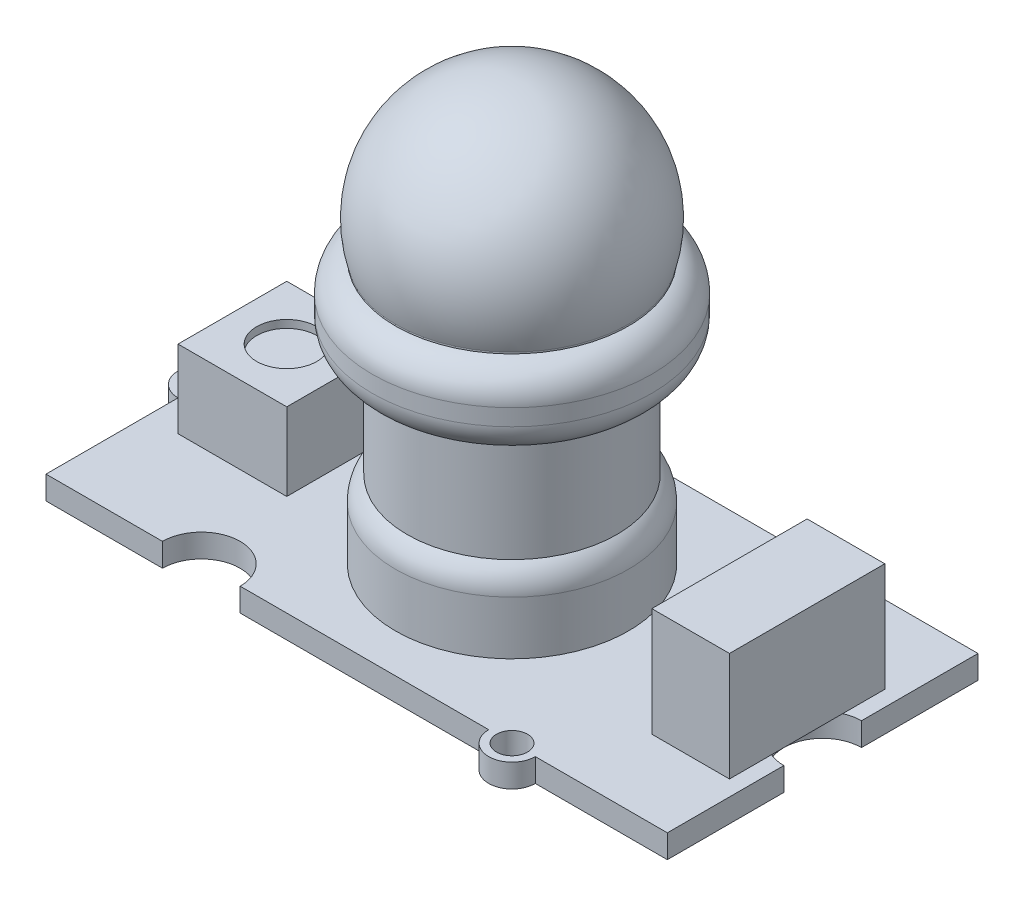
ISO-10303-21;
HEADER;
FILE_DESCRIPTION(('STEP AP214'),'2;1');
FILE_NAME('part.step','',(''),(''),'','','');
FILE_SCHEMA(('AUTOMOTIVE_DESIGN { 1 0 10303 214 1 1 1 1 }'));
ENDSEC;
DATA;
#1=APPLICATION_CONTEXT('core data for automotive mechanical design processes');
#2=APPLICATION_PROTOCOL_DEFINITION('international standard','automotive_design',2000,#1);
#3=PRODUCT_CONTEXT('',#1,'mechanical');
#4=PRODUCT('Part','Part','',(#3));
#5=PRODUCT_RELATED_PRODUCT_CATEGORY('part','',(#4));
#6=PRODUCT_DEFINITION_FORMATION('','',#4);
#7=PRODUCT_DEFINITION_CONTEXT('part definition',#1,'design');
#8=PRODUCT_DEFINITION('design','',#6,#7);
#9=PRODUCT_DEFINITION_SHAPE('','',#8);
#10=(LENGTH_UNIT() NAMED_UNIT(*) SI_UNIT(.MILLI.,.METRE.));
#11=(NAMED_UNIT(*) PLANE_ANGLE_UNIT() SI_UNIT($,.RADIAN.));
#12=(NAMED_UNIT(*) SI_UNIT($,.STERADIAN.) SOLID_ANGLE_UNIT());
#13=UNCERTAINTY_MEASURE_WITH_UNIT(LENGTH_MEASURE(1.E-05),#10,'distance_accuracy_value','');
#14=(GEOMETRIC_REPRESENTATION_CONTEXT(3) GLOBAL_UNCERTAINTY_ASSIGNED_CONTEXT((#13)) GLOBAL_UNIT_ASSIGNED_CONTEXT((#10,
#11,#12)) REPRESENTATION_CONTEXT('',''));
#15=CARTESIAN_POINT('',(0.,0.,0.));
#16=DIRECTION('',(0.,0.,1.));
#17=DIRECTION('',(1.,0.,0.));
#18=AXIS2_PLACEMENT_3D('',#15,#16,#17);
#19=CARTESIAN_POINT('',(0.,1.5,0.));
#20=DIRECTION('',(0.,1.,0.));
#21=DIRECTION('',(0.,0.,1.));
#22=AXIS2_PLACEMENT_3D('',#19,#20,#21);
#23=PLANE('',#22);
#24=CARTESIAN_POINT('',(0.,1.5,0.));
#25=DIRECTION('',(0.,1.,0.));
#26=DIRECTION('',(0.,0.,1.));
#27=AXIS2_PLACEMENT_3D('',#24,#25,#26);
#28=CIRCLE('',#27,7.5);
#29=CARTESIAN_POINT('',(0.,1.5,7.5));
#30=VERTEX_POINT('',#29);
#31=EDGE_CURVE('E436',#30,#30,#28,.T.);
#32=ORIENTED_EDGE('',*,*,#31,.F.);
#33=EDGE_LOOP('',(#32));
#34=FACE_BOUND('',#33,.T.);
#35=CARTESIAN_POINT('',(10.,1.5,-10.));
#36=DIRECTION('',(0.,1.,0.));
#37=DIRECTION('',(0.,0.,1.));
#38=AXIS2_PLACEMENT_3D('',#35,#36,#37);
#39=CIRCLE('',#38,0.999999999999999);
#40=CARTESIAN_POINT('',(10.,1.5,-9.));
#41=VERTEX_POINT('',#40);
#42=EDGE_CURVE('E293',#41,#41,#39,.T.);
#43=ORIENTED_EDGE('',*,*,#42,.F.);
#44=EDGE_LOOP('',(#43));
#45=FACE_BOUND('',#44,.T.);
#46=CARTESIAN_POINT('',(9.99999999999999,1.5,10.));
#47=DIRECTION('',(0.,1.,0.));
#48=DIRECTION('',(0.,0.,1.));
#49=AXIS2_PLACEMENT_3D('',#46,#47,#48);
#50=CIRCLE('',#49,1.);
#51=CARTESIAN_POINT('',(9.99999999999999,1.5,11.));
#52=VERTEX_POINT('',#51);
#53=EDGE_CURVE('E297',#52,#52,#50,.T.);
#54=ORIENTED_EDGE('',*,*,#53,.F.);
#55=EDGE_LOOP('',(#54));
#56=FACE_BOUND('',#55,.T.);
#57=CARTESIAN_POINT('',(-20.,1.5,0.));
#58=DIRECTION('',(0.,1.,0.));
#59=DIRECTION('',(0.,0.,1.));
#60=AXIS2_PLACEMENT_3D('',#57,#58,#59);
#61=CIRCLE('',#60,1.);
#62=CARTESIAN_POINT('',(-20.,1.5,1.));
#63=VERTEX_POINT('',#62);
#64=EDGE_CURVE('E303',#63,#63,#61,.T.);
#65=ORIENTED_EDGE('',*,*,#64,.F.);
#66=EDGE_LOOP('',(#65));
#67=FACE_BOUND('',#66,.T.);
#68=DIRECTION('',(-1.,0.,0.));
#69=VECTOR('',#68,1.);
#70=CARTESIAN_POINT('',(-18.,1.5,-3.5));
#71=LINE('',#70,#69);
#72=CARTESIAN_POINT('',(-11.,1.5,-3.5));
#73=VERTEX_POINT('',#72);
#74=CARTESIAN_POINT('',(-18.,1.5,-3.5));
#75=VERTEX_POINT('',#74);
#76=EDGE_CURVE('E250',#73,#75,#71,.T.);
#77=ORIENTED_EDGE('',*,*,#76,.F.);
#78=DIRECTION('',(0.,0.,-1.));
#79=VECTOR('',#78,1.);
#80=CARTESIAN_POINT('',(-11.,1.5,-3.5));
#81=LINE('',#80,#79);
#82=CARTESIAN_POINT('',(-11.,1.5,3.5));
#83=VERTEX_POINT('',#82);
#84=EDGE_CURVE('E235',#83,#73,#81,.T.);
#85=ORIENTED_EDGE('',*,*,#84,.F.);
#86=DIRECTION('',(1.,0.,0.));
#87=VECTOR('',#86,1.);
#88=CARTESIAN_POINT('',(-18.,1.5,3.5));
#89=LINE('',#88,#87);
#90=CARTESIAN_POINT('',(-18.,1.5,3.5));
#91=VERTEX_POINT('',#90);
#92=EDGE_CURVE('E241',#91,#83,#89,.T.);
#93=ORIENTED_EDGE('',*,*,#92,.F.);
#94=DIRECTION('',(0.,0.,1.));
#95=VECTOR('',#94,1.);
#96=CARTESIAN_POINT('',(-18.,1.5,-3.5));
#97=LINE('',#96,#95);
#98=EDGE_CURVE('E252',#75,#91,#97,.T.);
#99=ORIENTED_EDGE('',*,*,#98,.F.);
#100=EDGE_LOOP('',(#77,#85,#93,#99));
#101=FACE_BOUND('',#100,.T.);
#102=DIRECTION('',(-1.,0.,0.));
#103=VECTOR('',#102,1.);
#104=CARTESIAN_POINT('',(14.,1.5,-5.));
#105=LINE('',#104,#103);
#106=CARTESIAN_POINT('',(19.,1.5,-5.));
#107=VERTEX_POINT('',#106);
#108=CARTESIAN_POINT('',(14.,1.5,-5.));
#109=VERTEX_POINT('',#108);
#110=EDGE_CURVE('E445',#107,#109,#105,.T.);
#111=ORIENTED_EDGE('',*,*,#110,.F.);
#112=DIRECTION('',(0.,0.,-1.));
#113=VECTOR('',#112,1.);
#114=CARTESIAN_POINT('',(19.,1.5,-5.));
#115=LINE('',#114,#113);
#116=CARTESIAN_POINT('',(19.,1.5,-2.29128784747792));
#117=VERTEX_POINT('',#116);
#118=EDGE_CURVE('E224',#117,#107,#115,.T.);
#119=ORIENTED_EDGE('',*,*,#118,.F.);
#120=CARTESIAN_POINT('',(20.,1.5,0.));
#121=DIRECTION('',(0.,1.,0.));
#122=DIRECTION('',(0.,0.,1.));
#123=AXIS2_PLACEMENT_3D('',#120,#121,#122);
#124=CIRCLE('',#123,2.5);
#125=CARTESIAN_POINT('',(20.,1.5,-2.5));
#126=VERTEX_POINT('',#125);
#127=EDGE_CURVE('E264',#126,#117,#124,.T.);
#128=ORIENTED_EDGE('',*,*,#127,.F.);
#129=DIRECTION('',(0.,0.,-1.));
#130=VECTOR('',#129,1.);
#131=CARTESIAN_POINT('',(20.,1.5,-10.));
#132=LINE('',#131,#130);
#133=CARTESIAN_POINT('',(20.,1.5,-10.));
#134=VERTEX_POINT('',#133);
#135=EDGE_CURVE('E346',#126,#134,#132,.T.);
#136=ORIENTED_EDGE('',*,*,#135,.T.);
#137=DIRECTION('',(-1.,0.,0.));
#138=VECTOR('',#137,1.);
#139=CARTESIAN_POINT('',(-20.,1.5,-10.));
#140=LINE('',#139,#138);
#141=CARTESIAN_POINT('',(11.5,1.5,-10.));
#142=VERTEX_POINT('',#141);
#143=EDGE_CURVE('E347',#134,#142,#140,.T.);
#144=ORIENTED_EDGE('',*,*,#143,.T.);
#145=CARTESIAN_POINT('',(10.,1.5,-10.));
#146=DIRECTION('',(0.,1.,0.));
#147=DIRECTION('',(0.,0.,1.));
#148=AXIS2_PLACEMENT_3D('',#145,#146,#147);
#149=CIRCLE('',#148,1.5);
#150=CARTESIAN_POINT('',(8.5,1.5,-10.));
#151=VERTEX_POINT('',#150);
#152=EDGE_CURVE('E321',#142,#151,#149,.T.);
#153=ORIENTED_EDGE('',*,*,#152,.T.);
#154=CARTESIAN_POINT('',(-7.50000000000001,1.5,-10.));
#155=VERTEX_POINT('',#154);
#156=EDGE_CURVE('E351',#151,#155,#140,.T.);
#157=ORIENTED_EDGE('',*,*,#156,.T.);
#158=CARTESIAN_POINT('',(-10.,1.5,-10.));
#159=DIRECTION('',(0.,1.,0.));
#160=DIRECTION('',(0.,0.,1.));
#161=AXIS2_PLACEMENT_3D('',#158,#159,#160);
#162=CIRCLE('',#161,2.5);
#163=CARTESIAN_POINT('',(-12.5,1.5,-10.));
#164=VERTEX_POINT('',#163);
#165=EDGE_CURVE('E274',#164,#155,#162,.T.);
#166=ORIENTED_EDGE('',*,*,#165,.F.);
#167=CARTESIAN_POINT('',(-20.,1.5,-10.));
#168=VERTEX_POINT('',#167);
#169=EDGE_CURVE('E345',#164,#168,#140,.T.);
#170=ORIENTED_EDGE('',*,*,#169,.T.);
#171=DIRECTION('',(0.,0.,1.));
#172=VECTOR('',#171,1.);
#173=CARTESIAN_POINT('',(-20.,1.5,-10.));
#174=LINE('',#173,#172);
#175=CARTESIAN_POINT('',(-20.,1.5,-1.5));
#176=VERTEX_POINT('',#175);
#177=EDGE_CURVE('E352',#168,#176,#174,.T.);
#178=ORIENTED_EDGE('',*,*,#177,.T.);
#179=CARTESIAN_POINT('',(-20.,1.5,0.));
#180=DIRECTION('',(0.,1.,0.));
#181=DIRECTION('',(0.,0.,1.));
#182=AXIS2_PLACEMENT_3D('',#179,#180,#181);
#183=CIRCLE('',#182,1.5);
#184=CARTESIAN_POINT('',(-20.,1.5,1.5));
#185=VERTEX_POINT('',#184);
#186=EDGE_CURVE('E331',#176,#185,#183,.T.);
#187=ORIENTED_EDGE('',*,*,#186,.T.);
#188=CARTESIAN_POINT('',(-20.,1.5,10.));
#189=VERTEX_POINT('',#188);
#190=EDGE_CURVE('E350',#185,#189,#174,.T.);
#191=ORIENTED_EDGE('',*,*,#190,.T.);
#192=DIRECTION('',(1.,0.,0.));
#193=VECTOR('',#192,1.);
#194=CARTESIAN_POINT('',(-20.,1.5,10.));
#195=LINE('',#194,#193);
#196=CARTESIAN_POINT('',(-12.5,1.5,10.));
#197=VERTEX_POINT('',#196);
#198=EDGE_CURVE('E356',#189,#197,#195,.T.);
#199=ORIENTED_EDGE('',*,*,#198,.T.);
#200=CARTESIAN_POINT('',(-10.,1.5,10.));
#201=DIRECTION('',(0.,1.,0.));
#202=DIRECTION('',(0.,0.,1.));
#203=AXIS2_PLACEMENT_3D('',#200,#201,#202);
#204=CIRCLE('',#203,2.5);
#205=CARTESIAN_POINT('',(-7.5,1.5,10.));
#206=VERTEX_POINT('',#205);
#207=EDGE_CURVE('E282',#206,#197,#204,.T.);
#208=ORIENTED_EDGE('',*,*,#207,.F.);
#209=CARTESIAN_POINT('',(8.49999999999999,1.5,10.));
#210=VERTEX_POINT('',#209);
#211=EDGE_CURVE('E360',#206,#210,#195,.T.);
#212=ORIENTED_EDGE('',*,*,#211,.T.);
#213=CARTESIAN_POINT('',(9.99999999999999,1.5,10.));
#214=DIRECTION('',(0.,1.,0.));
#215=DIRECTION('',(0.,0.,1.));
#216=AXIS2_PLACEMENT_3D('',#213,#214,#215);
#217=CIRCLE('',#216,1.5);
#218=CARTESIAN_POINT('',(11.5,1.5,10.));
#219=VERTEX_POINT('',#218);
#220=EDGE_CURVE('E309',#210,#219,#217,.T.);
#221=ORIENTED_EDGE('',*,*,#220,.T.);
#222=CARTESIAN_POINT('',(20.,1.5,10.));
#223=VERTEX_POINT('',#222);
#224=EDGE_CURVE('E355',#219,#223,#195,.T.);
#225=ORIENTED_EDGE('',*,*,#224,.T.);
#226=CARTESIAN_POINT('',(20.,1.5,2.5));
#227=VERTEX_POINT('',#226);
#228=EDGE_CURVE('E342',#223,#227,#132,.T.);
#229=ORIENTED_EDGE('',*,*,#228,.T.);
#230=CARTESIAN_POINT('',(19.,1.5,2.29128784747792));
#231=VERTEX_POINT('',#230);
#232=EDGE_CURVE('E263',#231,#227,#124,.T.);
#233=ORIENTED_EDGE('',*,*,#232,.F.);
#234=CARTESIAN_POINT('',(19.,1.5,5.));
#235=VERTEX_POINT('',#234);
#236=EDGE_CURVE('E47',#235,#231,#115,.T.);
#237=ORIENTED_EDGE('',*,*,#236,.F.);
#238=DIRECTION('',(1.,0.,0.));
#239=VECTOR('',#238,1.);
#240=CARTESIAN_POINT('',(14.,1.5,5.));
#241=LINE('',#240,#239);
#242=CARTESIAN_POINT('',(14.,1.5,5.));
#243=VERTEX_POINT('',#242);
#244=EDGE_CURVE('E220',#243,#235,#241,.T.);
#245=ORIENTED_EDGE('',*,*,#244,.F.);
#246=DIRECTION('',(0.,0.,1.));
#247=VECTOR('',#246,1.);
#248=CARTESIAN_POINT('',(14.,1.5,-5.));
#249=LINE('',#248,#247);
#250=EDGE_CURVE('E448',#109,#243,#249,.T.);
#251=ORIENTED_EDGE('',*,*,#250,.F.);
#252=EDGE_LOOP('',(#111,#119,#128,#136,#144,#153,#157,#166,#170,#178,#187,#191,#199,#208,#212,
#221,#225,#229,#233,#237,#245,#251));
#253=FACE_BOUND('',#252,.T.);
#254=ADVANCED_FACE('F32',(#34,#45,#56,#67,#101,#253),#23,.T.);
#255=CARTESIAN_POINT('',(20.,1.5,-10.));
#256=DIRECTION('',(-1.,0.,0.));
#257=DIRECTION('',(0.,0.,1.));
#258=AXIS2_PLACEMENT_3D('',#255,#256,#257);
#259=PLANE('',#258);
#260=DIRECTION('',(0.,0.,-1.));
#261=VECTOR('',#260,1.);
#262=CARTESIAN_POINT('',(20.,0.,-10.));
#263=LINE('',#262,#261);
#264=CARTESIAN_POINT('',(20.,0.,10.));
#265=VERTEX_POINT('',#264);
#266=CARTESIAN_POINT('',(20.,0.,2.5));
#267=VERTEX_POINT('',#266);
#268=EDGE_CURVE('E361',#265,#267,#263,.T.);
#269=ORIENTED_EDGE('',*,*,#268,.T.);
#270=DIRECTION('',(0.,1.,0.));
#271=VECTOR('',#270,1.);
#272=CARTESIAN_POINT('',(20.,0.,2.5));
#273=LINE('',#272,#271);
#274=EDGE_CURVE('E271',#267,#227,#273,.T.);
#275=ORIENTED_EDGE('',*,*,#274,.T.);
#276=ORIENTED_EDGE('',*,*,#228,.F.);
#277=DIRECTION('',(0.,-1.,0.));
#278=VECTOR('',#277,1.);
#279=CARTESIAN_POINT('',(20.,1.5,10.));
#280=LINE('',#279,#278);
#281=EDGE_CURVE('E359',#223,#265,#280,.T.);
#282=ORIENTED_EDGE('',*,*,#281,.T.);
#283=EDGE_LOOP('',(#269,#275,#276,#282));
#284=FACE_BOUND('',#283,.T.);
#285=ADVANCED_FACE('F478',(#284),#259,.F.);
#286=CARTESIAN_POINT('',(-20.,1.5,-10.));
#287=DIRECTION('',(0.,0.,1.));
#288=DIRECTION('',(1.,0.,0.));
#289=AXIS2_PLACEMENT_3D('',#286,#287,#288);
#290=PLANE('',#289);
#291=DIRECTION('',(-1.,0.,0.));
#292=VECTOR('',#291,1.);
#293=CARTESIAN_POINT('',(-20.,0.,-10.));
#294=LINE('',#293,#292);
#295=CARTESIAN_POINT('',(8.5,0.,-10.));
#296=VERTEX_POINT('',#295);
#297=CARTESIAN_POINT('',(-7.50000000000001,0.,-10.));
#298=VERTEX_POINT('',#297);
#299=EDGE_CURVE('E369',#296,#298,#294,.T.);
#300=ORIENTED_EDGE('',*,*,#299,.T.);
#301=DIRECTION('',(0.,1.,0.));
#302=VECTOR('',#301,1.);
#303=CARTESIAN_POINT('',(-7.50000000000001,0.,-10.));
#304=LINE('',#303,#302);
#305=EDGE_CURVE('E279',#298,#155,#304,.T.);
#306=ORIENTED_EDGE('',*,*,#305,.T.);
#307=ORIENTED_EDGE('',*,*,#156,.F.);
#308=DIRECTION('',(0.,1.,0.));
#309=VECTOR('',#308,1.);
#310=CARTESIAN_POINT('',(8.5,0.,-10.));
#311=LINE('',#310,#309);
#312=EDGE_CURVE('E324',#151,#296,#311,.F.);
#313=ORIENTED_EDGE('',*,*,#312,.T.);
#314=EDGE_LOOP('',(#300,#306,#307,#313));
#315=FACE_BOUND('',#314,.T.);
#316=ADVANCED_FACE('F484',(#315),#290,.F.);
#317=CARTESIAN_POINT('',(-20.,1.5,10.));
#318=DIRECTION('',(0.,0.,-1.));
#319=DIRECTION('',(-1.,0.,0.));
#320=AXIS2_PLACEMENT_3D('',#317,#318,#319);
#321=PLANE('',#320);
#322=DIRECTION('',(1.,0.,0.));
#323=VECTOR('',#322,1.);
#324=CARTESIAN_POINT('',(-20.,0.,10.));
#325=LINE('',#324,#323);
#326=CARTESIAN_POINT('',(-20.,0.,10.));
#327=VERTEX_POINT('',#326);
#328=CARTESIAN_POINT('',(-12.5,0.,10.));
#329=VERTEX_POINT('',#328);
#330=EDGE_CURVE('E374',#327,#329,#325,.T.);
#331=ORIENTED_EDGE('',*,*,#330,.T.);
#332=DIRECTION('',(0.,1.,0.));
#333=VECTOR('',#332,1.);
#334=CARTESIAN_POINT('',(-12.5,0.,10.));
#335=LINE('',#334,#333);
#336=EDGE_CURVE('E290',#329,#197,#335,.T.);
#337=ORIENTED_EDGE('',*,*,#336,.T.);
#338=ORIENTED_EDGE('',*,*,#198,.F.);
#339=DIRECTION('',(0.,-1.,0.));
#340=VECTOR('',#339,1.);
#341=CARTESIAN_POINT('',(-20.,1.5,10.));
#342=LINE('',#341,#340);
#343=EDGE_CURVE('E380',#189,#327,#342,.T.);
#344=ORIENTED_EDGE('',*,*,#343,.T.);
#345=EDGE_LOOP('',(#331,#337,#338,#344));
#346=FACE_BOUND('',#345,.T.);
#347=ADVANCED_FACE('F503',(#346),#321,.F.);
#348=ORIENTED_EDGE('',*,*,#211,.F.);
#349=DIRECTION('',(0.,1.,0.));
#350=VECTOR('',#349,1.);
#351=CARTESIAN_POINT('',(-7.5,0.,10.));
#352=LINE('',#351,#350);
#353=CARTESIAN_POINT('',(-7.5,0.,10.));
#354=VERTEX_POINT('',#353);
#355=EDGE_CURVE('E286',#206,#354,#352,.F.);
#356=ORIENTED_EDGE('',*,*,#355,.T.);
#357=CARTESIAN_POINT('',(8.49999999999999,0.,10.));
#358=VERTEX_POINT('',#357);
#359=EDGE_CURVE('E377',#354,#358,#325,.T.);
#360=ORIENTED_EDGE('',*,*,#359,.T.);
#361=DIRECTION('',(0.,1.,0.));
#362=VECTOR('',#361,1.);
#363=CARTESIAN_POINT('',(8.49999999999999,0.,10.));
#364=LINE('',#363,#362);
#365=EDGE_CURVE('E318',#358,#210,#364,.T.);
#366=ORIENTED_EDGE('',*,*,#365,.T.);
#367=EDGE_LOOP('',(#348,#356,#360,#366));
#368=FACE_BOUND('',#367,.T.);
#369=ADVANCED_FACE('F504',(#368),#321,.F.);
#370=CARTESIAN_POINT('',(20.,0.,-10.));
#371=VERTEX_POINT('',#370);
#372=CARTESIAN_POINT('',(11.5,0.,-10.));
#373=VERTEX_POINT('',#372);
#374=EDGE_CURVE('E365',#371,#373,#294,.T.);
#375=ORIENTED_EDGE('',*,*,#374,.T.);
#376=DIRECTION('',(0.,1.,0.));
#377=VECTOR('',#376,1.);
#378=CARTESIAN_POINT('',(11.5,0.,-10.));
#379=LINE('',#378,#377);
#380=EDGE_CURVE('E328',#373,#142,#379,.T.);
#381=ORIENTED_EDGE('',*,*,#380,.T.);
#382=ORIENTED_EDGE('',*,*,#143,.F.);
#383=DIRECTION('',(0.,-1.,0.));
#384=VECTOR('',#383,1.);
#385=CARTESIAN_POINT('',(20.,1.5,-10.));
#386=LINE('',#385,#384);
#387=EDGE_CURVE('E386',#134,#371,#386,.T.);
#388=ORIENTED_EDGE('',*,*,#387,.T.);
#389=EDGE_LOOP('',(#375,#381,#382,#388));
#390=FACE_BOUND('',#389,.T.);
#391=ADVANCED_FACE('F512',(#390),#290,.F.);
#392=CARTESIAN_POINT('',(-20.,1.5,-10.));
#393=DIRECTION('',(1.,0.,0.));
#394=DIRECTION('',(0.,0.,-1.));
#395=AXIS2_PLACEMENT_3D('',#392,#393,#394);
#396=PLANE('',#395);
#397=DIRECTION('',(0.,0.,1.));
#398=VECTOR('',#397,1.);
#399=CARTESIAN_POINT('',(-20.,0.,-10.));
#400=LINE('',#399,#398);
#401=CARTESIAN_POINT('',(-20.,0.,-10.));
#402=VERTEX_POINT('',#401);
#403=CARTESIAN_POINT('',(-20.,0.,-1.5));
#404=VERTEX_POINT('',#403);
#405=EDGE_CURVE('E370',#402,#404,#400,.T.);
#406=ORIENTED_EDGE('',*,*,#405,.T.);
#407=DIRECTION('',(0.,1.,0.));
#408=VECTOR('',#407,1.);
#409=CARTESIAN_POINT('',(-20.,0.,-1.5));
#410=LINE('',#409,#408);
#411=EDGE_CURVE('E338',#404,#176,#410,.T.);
#412=ORIENTED_EDGE('',*,*,#411,.T.);
#413=ORIENTED_EDGE('',*,*,#177,.F.);
#414=DIRECTION('',(0.,-1.,0.));
#415=VECTOR('',#414,1.);
#416=CARTESIAN_POINT('',(-20.,1.5,-10.));
#417=LINE('',#416,#415);
#418=EDGE_CURVE('E383',#168,#402,#417,.T.);
#419=ORIENTED_EDGE('',*,*,#418,.T.);
#420=EDGE_LOOP('',(#406,#412,#413,#419));
#421=FACE_BOUND('',#420,.T.);
#422=ADVANCED_FACE('F509',(#421),#396,.F.);
#423=ORIENTED_EDGE('',*,*,#135,.F.);
#424=DIRECTION('',(0.,1.,0.));
#425=VECTOR('',#424,1.);
#426=CARTESIAN_POINT('',(20.,0.,-2.5));
#427=LINE('',#426,#425);
#428=CARTESIAN_POINT('',(20.,0.,-2.5));
#429=VERTEX_POINT('',#428);
#430=EDGE_CURVE('E267',#126,#429,#427,.F.);
#431=ORIENTED_EDGE('',*,*,#430,.T.);
#432=EDGE_CURVE('E341',#429,#371,#263,.T.);
#433=ORIENTED_EDGE('',*,*,#432,.T.);
#434=ORIENTED_EDGE('',*,*,#387,.F.);
#435=EDGE_LOOP('',(#423,#431,#433,#434));
#436=FACE_BOUND('',#435,.T.);
#437=ADVANCED_FACE('F487',(#436),#259,.F.);
#438=ORIENTED_EDGE('',*,*,#169,.F.);
#439=DIRECTION('',(0.,1.,0.));
#440=VECTOR('',#439,1.);
#441=CARTESIAN_POINT('',(-12.5,0.,-10.));
#442=LINE('',#441,#440);
#443=CARTESIAN_POINT('',(-12.5,0.,-10.));
#444=VERTEX_POINT('',#443);
#445=EDGE_CURVE('E276',#164,#444,#442,.F.);
#446=ORIENTED_EDGE('',*,*,#445,.T.);
#447=EDGE_CURVE('E364',#444,#402,#294,.T.);
#448=ORIENTED_EDGE('',*,*,#447,.T.);
#449=ORIENTED_EDGE('',*,*,#418,.F.);
#450=EDGE_LOOP('',(#438,#446,#448,#449));
#451=FACE_BOUND('',#450,.T.);
#452=ADVANCED_FACE('F507',(#451),#290,.F.);
#453=ORIENTED_EDGE('',*,*,#190,.F.);
#454=DIRECTION('',(0.,1.,0.));
#455=VECTOR('',#454,1.);
#456=CARTESIAN_POINT('',(-20.,0.,1.5));
#457=LINE('',#456,#455);
#458=CARTESIAN_POINT('',(-20.,0.,1.5));
#459=VERTEX_POINT('',#458);
#460=EDGE_CURVE('E334',#185,#459,#457,.F.);
#461=ORIENTED_EDGE('',*,*,#460,.T.);
#462=EDGE_CURVE('E368',#459,#327,#400,.T.);
#463=ORIENTED_EDGE('',*,*,#462,.T.);
#464=ORIENTED_EDGE('',*,*,#343,.F.);
#465=EDGE_LOOP('',(#453,#461,#463,#464));
#466=FACE_BOUND('',#465,.T.);
#467=ADVANCED_FACE('F501',(#466),#396,.F.);
#468=ORIENTED_EDGE('',*,*,#224,.F.);
#469=DIRECTION('',(0.,1.,0.));
#470=VECTOR('',#469,1.);
#471=CARTESIAN_POINT('',(11.5,0.,10.));
#472=LINE('',#471,#470);
#473=CARTESIAN_POINT('',(11.5,0.,10.));
#474=VERTEX_POINT('',#473);
#475=EDGE_CURVE('E314',#219,#474,#472,.F.);
#476=ORIENTED_EDGE('',*,*,#475,.T.);
#477=EDGE_CURVE('E373',#474,#265,#325,.T.);
#478=ORIENTED_EDGE('',*,*,#477,.T.);
#479=ORIENTED_EDGE('',*,*,#281,.F.);
#480=EDGE_LOOP('',(#468,#476,#478,#479));
#481=FACE_BOUND('',#480,.T.);
#482=ADVANCED_FACE('F497',(#481),#321,.F.);
#483=CARTESIAN_POINT('',(0.,0.,0.));
#484=DIRECTION('',(0.,1.,0.));
#485=DIRECTION('',(0.,0.,1.));
#486=AXIS2_PLACEMENT_3D('',#483,#484,#485);
#487=PLANE('',#486);
#488=CARTESIAN_POINT('',(10.,0.,-10.));
#489=DIRECTION('',(0.,1.,0.));
#490=DIRECTION('',(0.,0.,1.));
#491=AXIS2_PLACEMENT_3D('',#488,#489,#490);
#492=CIRCLE('',#491,0.999999999999999);
#493=CARTESIAN_POINT('',(10.,0.,-9.));
#494=VERTEX_POINT('',#493);
#495=EDGE_CURVE('E294',#494,#494,#492,.T.);
#496=ORIENTED_EDGE('',*,*,#495,.T.);
#497=EDGE_LOOP('',(#496));
#498=FACE_BOUND('',#497,.T.);
#499=CARTESIAN_POINT('',(9.99999999999999,0.,10.));
#500=DIRECTION('',(0.,1.,0.));
#501=DIRECTION('',(0.,0.,1.));
#502=AXIS2_PLACEMENT_3D('',#499,#500,#501);
#503=CIRCLE('',#502,1.);
#504=CARTESIAN_POINT('',(9.99999999999999,0.,11.));
#505=VERTEX_POINT('',#504);
#506=EDGE_CURVE('E300',#505,#505,#503,.T.);
#507=ORIENTED_EDGE('',*,*,#506,.T.);
#508=EDGE_LOOP('',(#507));
#509=FACE_BOUND('',#508,.T.);
#510=CARTESIAN_POINT('',(-20.,0.,0.));
#511=DIRECTION('',(0.,1.,0.));
#512=DIRECTION('',(0.,0.,1.));
#513=AXIS2_PLACEMENT_3D('',#510,#511,#512);
#514=CIRCLE('',#513,1.);
#515=CARTESIAN_POINT('',(-20.,0.,1.));
#516=VERTEX_POINT('',#515);
#517=EDGE_CURVE('E306',#516,#516,#514,.T.);
#518=ORIENTED_EDGE('',*,*,#517,.T.);
#519=EDGE_LOOP('',(#518));
#520=FACE_BOUND('',#519,.T.);
#521=ORIENTED_EDGE('',*,*,#432,.F.);
#522=CARTESIAN_POINT('',(20.,0.,0.));
#523=DIRECTION('',(0.,1.,0.));
#524=DIRECTION('',(0.,0.,1.));
#525=AXIS2_PLACEMENT_3D('',#522,#523,#524);
#526=CIRCLE('',#525,2.5);
#527=EDGE_CURVE('E392',#429,#267,#526,.T.);
#528=ORIENTED_EDGE('',*,*,#527,.T.);
#529=ORIENTED_EDGE('',*,*,#268,.F.);
#530=ORIENTED_EDGE('',*,*,#477,.F.);
#531=CARTESIAN_POINT('',(9.99999999999999,0.,10.));
#532=DIRECTION('',(0.,1.,0.));
#533=DIRECTION('',(0.,0.,1.));
#534=AXIS2_PLACEMENT_3D('',#531,#532,#533);
#535=CIRCLE('',#534,1.5);
#536=EDGE_CURVE('E312',#358,#474,#535,.T.);
#537=ORIENTED_EDGE('',*,*,#536,.F.);
#538=ORIENTED_EDGE('',*,*,#359,.F.);
#539=CARTESIAN_POINT('',(-10.,0.,10.));
#540=DIRECTION('',(0.,1.,0.));
#541=DIRECTION('',(0.,0.,1.));
#542=AXIS2_PLACEMENT_3D('',#539,#540,#541);
#543=CIRCLE('',#542,2.5);
#544=EDGE_CURVE('E283',#354,#329,#543,.T.);
#545=ORIENTED_EDGE('',*,*,#544,.T.);
#546=ORIENTED_EDGE('',*,*,#330,.F.);
#547=ORIENTED_EDGE('',*,*,#462,.F.);
#548=CARTESIAN_POINT('',(-20.,0.,0.));
#549=DIRECTION('',(0.,1.,0.));
#550=DIRECTION('',(0.,0.,1.));
#551=AXIS2_PLACEMENT_3D('',#548,#549,#550);
#552=CIRCLE('',#551,1.5);
#553=EDGE_CURVE('E332',#404,#459,#552,.T.);
#554=ORIENTED_EDGE('',*,*,#553,.F.);
#555=ORIENTED_EDGE('',*,*,#405,.F.);
#556=ORIENTED_EDGE('',*,*,#447,.F.);
#557=CARTESIAN_POINT('',(-10.,0.,-10.));
#558=DIRECTION('',(0.,1.,0.));
#559=DIRECTION('',(0.,0.,1.));
#560=AXIS2_PLACEMENT_3D('',#557,#558,#559);
#561=CIRCLE('',#560,2.5);
#562=EDGE_CURVE('E389',#444,#298,#561,.T.);
#563=ORIENTED_EDGE('',*,*,#562,.T.);
#564=ORIENTED_EDGE('',*,*,#299,.F.);
#565=CARTESIAN_POINT('',(10.,0.,-10.));
#566=DIRECTION('',(0.,1.,0.));
#567=DIRECTION('',(0.,0.,1.));
#568=AXIS2_PLACEMENT_3D('',#565,#566,#567);
#569=CIRCLE('',#568,1.5);
#570=EDGE_CURVE('E322',#373,#296,#569,.T.);
#571=ORIENTED_EDGE('',*,*,#570,.F.);
#572=ORIENTED_EDGE('',*,*,#374,.F.);
#573=EDGE_LOOP('',(#521,#528,#529,#530,#537,#538,#545,#546,#547,#554,#555,#556,#563,#564,#571,#572));
#574=FACE_BOUND('',#573,.T.);
#575=ADVANCED_FACE('F494',(#498,#509,#520,#574),#487,.F.);
#576=CARTESIAN_POINT('',(-20.,0.,0.));
#577=DIRECTION('',(0.,1.,0.));
#578=DIRECTION('',(0.,0.,1.));
#579=AXIS2_PLACEMENT_3D('',#576,#577,#578);
#580=CYLINDRICAL_SURFACE('',#579,1.5);
#581=ORIENTED_EDGE('',*,*,#411,.F.);
#582=ORIENTED_EDGE('',*,*,#553,.T.);
#583=ORIENTED_EDGE('',*,*,#460,.F.);
#584=ORIENTED_EDGE('',*,*,#186,.F.);
#585=EDGE_LOOP('',(#581,#582,#583,#584));
#586=FACE_BOUND('',#585,.T.);
#587=ADVANCED_FACE('F492',(#586),#580,.T.);
#588=CARTESIAN_POINT('',(10.,0.,-10.));
#589=DIRECTION('',(0.,1.,0.));
#590=DIRECTION('',(0.,0.,1.));
#591=AXIS2_PLACEMENT_3D('',#588,#589,#590);
#592=CYLINDRICAL_SURFACE('',#591,1.5);
#593=ORIENTED_EDGE('',*,*,#380,.F.);
#594=ORIENTED_EDGE('',*,*,#570,.T.);
#595=ORIENTED_EDGE('',*,*,#312,.F.);
#596=ORIENTED_EDGE('',*,*,#152,.F.);
#597=EDGE_LOOP('',(#593,#594,#595,#596));
#598=FACE_BOUND('',#597,.T.);
#599=ADVANCED_FACE('F598',(#598),#592,.T.);
#600=CARTESIAN_POINT('',(9.99999999999999,0.,10.));
#601=DIRECTION('',(0.,1.,0.));
#602=DIRECTION('',(0.,0.,1.));
#603=AXIS2_PLACEMENT_3D('',#600,#601,#602);
#604=CYLINDRICAL_SURFACE('',#603,1.5);
#605=ORIENTED_EDGE('',*,*,#365,.F.);
#606=ORIENTED_EDGE('',*,*,#536,.T.);
#607=ORIENTED_EDGE('',*,*,#475,.F.);
#608=ORIENTED_EDGE('',*,*,#220,.F.);
#609=EDGE_LOOP('',(#605,#606,#607,#608));
#610=FACE_BOUND('',#609,.T.);
#611=ADVANCED_FACE('F595',(#610),#604,.T.);
#612=CARTESIAN_POINT('',(-20.,0.,0.));
#613=DIRECTION('',(0.,1.,0.));
#614=DIRECTION('',(0.,0.,1.));
#615=AXIS2_PLACEMENT_3D('',#612,#613,#614);
#616=CYLINDRICAL_SURFACE('',#615,1.);
#617=ORIENTED_EDGE('',*,*,#517,.F.);
#618=EDGE_LOOP('',(#617));
#619=FACE_BOUND('',#618,.T.);
#620=ORIENTED_EDGE('',*,*,#64,.T.);
#621=EDGE_LOOP('',(#620));
#622=FACE_BOUND('',#621,.T.);
#623=ADVANCED_FACE('F591',(#619,#622),#616,.F.);
#624=CARTESIAN_POINT('',(9.99999999999999,0.,10.));
#625=DIRECTION('',(0.,1.,0.));
#626=DIRECTION('',(0.,0.,1.));
#627=AXIS2_PLACEMENT_3D('',#624,#625,#626);
#628=CYLINDRICAL_SURFACE('',#627,1.);
#629=ORIENTED_EDGE('',*,*,#506,.F.);
#630=EDGE_LOOP('',(#629));
#631=FACE_BOUND('',#630,.T.);
#632=ORIENTED_EDGE('',*,*,#53,.T.);
#633=EDGE_LOOP('',(#632));
#634=FACE_BOUND('',#633,.T.);
#635=ADVANCED_FACE('F587',(#631,#634),#628,.F.);
#636=CARTESIAN_POINT('',(10.,0.,-10.));
#637=DIRECTION('',(0.,1.,0.));
#638=DIRECTION('',(0.,0.,1.));
#639=AXIS2_PLACEMENT_3D('',#636,#637,#638);
#640=CYLINDRICAL_SURFACE('',#639,0.999999999999999);
#641=ORIENTED_EDGE('',*,*,#495,.F.);
#642=EDGE_LOOP('',(#641));
#643=FACE_BOUND('',#642,.T.);
#644=ORIENTED_EDGE('',*,*,#42,.T.);
#645=EDGE_LOOP('',(#644));
#646=FACE_BOUND('',#645,.T.);
#647=ADVANCED_FACE('F583',(#643,#646),#640,.F.);
#648=CARTESIAN_POINT('',(-10.,0.,10.));
#649=DIRECTION('',(0.,1.,0.));
#650=DIRECTION('',(0.,0.,1.));
#651=AXIS2_PLACEMENT_3D('',#648,#649,#650);
#652=CYLINDRICAL_SURFACE('',#651,2.5);
#653=ORIENTED_EDGE('',*,*,#544,.F.);
#654=ORIENTED_EDGE('',*,*,#355,.F.);
#655=ORIENTED_EDGE('',*,*,#207,.T.);
#656=ORIENTED_EDGE('',*,*,#336,.F.);
#657=EDGE_LOOP('',(#653,#654,#655,#656));
#658=FACE_BOUND('',#657,.T.);
#659=ADVANCED_FACE('F579',(#658),#652,.F.);
#660=CARTESIAN_POINT('',(-10.,0.,-10.));
#661=DIRECTION('',(0.,1.,0.));
#662=DIRECTION('',(0.,0.,1.));
#663=AXIS2_PLACEMENT_3D('',#660,#661,#662);
#664=CYLINDRICAL_SURFACE('',#663,2.5);
#665=ORIENTED_EDGE('',*,*,#562,.F.);
#666=ORIENTED_EDGE('',*,*,#445,.F.);
#667=ORIENTED_EDGE('',*,*,#165,.T.);
#668=ORIENTED_EDGE('',*,*,#305,.F.);
#669=EDGE_LOOP('',(#665,#666,#667,#668));
#670=FACE_BOUND('',#669,.T.);
#671=ADVANCED_FACE('F576',(#670),#664,.F.);
#672=CARTESIAN_POINT('',(20.,0.,0.));
#673=DIRECTION('',(0.,1.,0.));
#674=DIRECTION('',(0.,0.,1.));
#675=AXIS2_PLACEMENT_3D('',#672,#673,#674);
#676=CYLINDRICAL_SURFACE('',#675,2.5);
#677=ORIENTED_EDGE('',*,*,#527,.F.);
#678=ORIENTED_EDGE('',*,*,#430,.F.);
#679=ORIENTED_EDGE('',*,*,#127,.T.);
#680=EDGE_CURVE('E268',#117,#231,#124,.T.);
#681=ORIENTED_EDGE('',*,*,#680,.T.);
#682=ORIENTED_EDGE('',*,*,#232,.T.);
#683=ORIENTED_EDGE('',*,*,#274,.F.);
#684=EDGE_LOOP('',(#677,#678,#679,#681,#682,#683));
#685=FACE_BOUND('',#684,.T.);
#686=ADVANCED_FACE('F463',(#685),#676,.F.);
#687=CARTESIAN_POINT('',(-11.,6.5,-3.5));
#688=DIRECTION('',(-1.,0.,0.));
#689=DIRECTION('',(0.,0.,1.));
#690=AXIS2_PLACEMENT_3D('',#687,#688,#689);
#691=PLANE('',#690);
#692=ORIENTED_EDGE('',*,*,#84,.T.);
#693=DIRECTION('',(0.,-1.,0.));
#694=VECTOR('',#693,1.);
#695=CARTESIAN_POINT('',(-11.,6.5,-3.5));
#696=LINE('',#695,#694);
#697=CARTESIAN_POINT('',(-11.,6.5,-3.5));
#698=VERTEX_POINT('',#697);
#699=EDGE_CURVE('E261',#698,#73,#696,.T.);
#700=ORIENTED_EDGE('',*,*,#699,.F.);
#701=DIRECTION('',(0.,0.,-1.));
#702=VECTOR('',#701,1.);
#703=CARTESIAN_POINT('',(-11.,6.5,-3.5));
#704=LINE('',#703,#702);
#705=CARTESIAN_POINT('',(-11.,6.5,3.5));
#706=VERTEX_POINT('',#705);
#707=EDGE_CURVE('E237',#706,#698,#704,.T.);
#708=ORIENTED_EDGE('',*,*,#707,.F.);
#709=DIRECTION('',(0.,-1.,0.));
#710=VECTOR('',#709,1.);
#711=CARTESIAN_POINT('',(-11.,6.5,3.5));
#712=LINE('',#711,#710);
#713=EDGE_CURVE('E247',#706,#83,#712,.T.);
#714=ORIENTED_EDGE('',*,*,#713,.T.);
#715=EDGE_LOOP('',(#692,#700,#708,#714));
#716=FACE_BOUND('',#715,.T.);
#717=ADVANCED_FACE('F569',(#716),#691,.F.);
#718=CARTESIAN_POINT('',(-18.,6.5,-3.5));
#719=DIRECTION('',(0.,0.,1.));
#720=DIRECTION('',(1.,0.,0.));
#721=AXIS2_PLACEMENT_3D('',#718,#719,#720);
#722=PLANE('',#721);
#723=ORIENTED_EDGE('',*,*,#76,.T.);
#724=DIRECTION('',(0.,-1.,0.));
#725=VECTOR('',#724,1.);
#726=CARTESIAN_POINT('',(-18.,6.5,-3.5));
#727=LINE('',#726,#725);
#728=CARTESIAN_POINT('',(-18.,6.5,-3.5));
#729=VERTEX_POINT('',#728);
#730=EDGE_CURVE('E258',#729,#75,#727,.T.);
#731=ORIENTED_EDGE('',*,*,#730,.F.);
#732=DIRECTION('',(-1.,0.,0.));
#733=VECTOR('',#732,1.);
#734=CARTESIAN_POINT('',(-18.,6.5,-3.5));
#735=LINE('',#734,#733);
#736=EDGE_CURVE('E240',#698,#729,#735,.T.);
#737=ORIENTED_EDGE('',*,*,#736,.F.);
#738=ORIENTED_EDGE('',*,*,#699,.T.);
#739=EDGE_LOOP('',(#723,#731,#737,#738));
#740=FACE_BOUND('',#739,.T.);
#741=ADVANCED_FACE('F565',(#740),#722,.F.);
#742=CARTESIAN_POINT('',(-18.,6.5,-3.5));
#743=DIRECTION('',(1.,0.,0.));
#744=DIRECTION('',(0.,0.,-1.));
#745=AXIS2_PLACEMENT_3D('',#742,#743,#744);
#746=PLANE('',#745);
#747=ORIENTED_EDGE('',*,*,#98,.T.);
#748=DIRECTION('',(0.,-1.,0.));
#749=VECTOR('',#748,1.);
#750=CARTESIAN_POINT('',(-18.,6.5,3.5));
#751=LINE('',#750,#749);
#752=CARTESIAN_POINT('',(-18.,6.5,3.5));
#753=VERTEX_POINT('',#752);
#754=EDGE_CURVE('E55',#753,#91,#751,.T.);
#755=ORIENTED_EDGE('',*,*,#754,.F.);
#756=DIRECTION('',(0.,0.,1.));
#757=VECTOR('',#756,1.);
#758=CARTESIAN_POINT('',(-18.,6.5,-3.5));
#759=LINE('',#758,#757);
#760=EDGE_CURVE('E243',#729,#753,#759,.T.);
#761=ORIENTED_EDGE('',*,*,#760,.F.);
#762=ORIENTED_EDGE('',*,*,#730,.T.);
#763=EDGE_LOOP('',(#747,#755,#761,#762));
#764=FACE_BOUND('',#763,.T.);
#765=ADVANCED_FACE('F562',(#764),#746,.F.);
#766=CARTESIAN_POINT('',(-18.,6.5,3.5));
#767=DIRECTION('',(0.,0.,-1.));
#768=DIRECTION('',(-1.,0.,0.));
#769=AXIS2_PLACEMENT_3D('',#766,#767,#768);
#770=PLANE('',#769);
#771=ORIENTED_EDGE('',*,*,#92,.T.);
#772=ORIENTED_EDGE('',*,*,#713,.F.);
#773=DIRECTION('',(1.,0.,0.));
#774=VECTOR('',#773,1.);
#775=CARTESIAN_POINT('',(-18.,6.5,3.5));
#776=LINE('',#775,#774);
#777=EDGE_CURVE('E245',#753,#706,#776,.T.);
#778=ORIENTED_EDGE('',*,*,#777,.F.);
#779=ORIENTED_EDGE('',*,*,#754,.T.);
#780=EDGE_LOOP('',(#771,#772,#778,#779));
#781=FACE_BOUND('',#780,.T.);
#782=ADVANCED_FACE('F558',(#781),#770,.F.);
#783=CARTESIAN_POINT('',(0.,6.5,0.));
#784=DIRECTION('',(0.,1.,0.));
#785=DIRECTION('',(0.,0.,1.));
#786=AXIS2_PLACEMENT_3D('',#783,#784,#785);
#787=PLANE('',#786);
#788=CARTESIAN_POINT('',(-14.5,6.5,0.));
#789=DIRECTION('',(0.,1.,0.));
#790=DIRECTION('',(0.,0.,1.));
#791=AXIS2_PLACEMENT_3D('',#788,#789,#790);
#792=CIRCLE('',#791,1.94075389858249);
#793=CARTESIAN_POINT('',(-14.5,6.5,1.94075389858249));
#794=VERTEX_POINT('',#793);
#795=EDGE_CURVE('E225',#794,#794,#792,.T.);
#796=ORIENTED_EDGE('',*,*,#795,.F.);
#797=EDGE_LOOP('',(#796));
#798=FACE_BOUND('',#797,.T.);
#799=ORIENTED_EDGE('',*,*,#707,.T.);
#800=ORIENTED_EDGE('',*,*,#736,.T.);
#801=ORIENTED_EDGE('',*,*,#760,.T.);
#802=ORIENTED_EDGE('',*,*,#777,.T.);
#803=EDGE_LOOP('',(#799,#800,#801,#802));
#804=FACE_BOUND('',#803,.T.);
#805=ADVANCED_FACE('F552',(#798,#804),#787,.T.);
#806=CARTESIAN_POINT('',(-14.5,6.,0.));
#807=DIRECTION('',(0.,1.,0.));
#808=DIRECTION('',(0.,0.,1.));
#809=AXIS2_PLACEMENT_3D('',#806,#807,#808);
#810=CYLINDRICAL_SURFACE('',#809,1.94075389858249);
#811=CARTESIAN_POINT('',(-14.5,6.,0.));
#812=DIRECTION('',(0.,1.,0.));
#813=DIRECTION('',(0.,0.,1.));
#814=AXIS2_PLACEMENT_3D('',#811,#812,#813);
#815=CIRCLE('',#814,1.94075389858249);
#816=CARTESIAN_POINT('',(-14.5,6.,1.94075389858249));
#817=VERTEX_POINT('',#816);
#818=EDGE_CURVE('E228',#817,#817,#815,.T.);
#819=ORIENTED_EDGE('',*,*,#818,.F.);
#820=EDGE_LOOP('',(#819));
#821=FACE_BOUND('',#820,.T.);
#822=ORIENTED_EDGE('',*,*,#795,.T.);
#823=EDGE_LOOP('',(#822));
#824=FACE_BOUND('',#823,.T.);
#825=ADVANCED_FACE('F546',(#821,#824),#810,.F.);
#826=CARTESIAN_POINT('',(-14.5,6.,0.));
#827=DIRECTION('',(0.,1.,0.));
#828=DIRECTION('',(0.,0.,1.));
#829=AXIS2_PLACEMENT_3D('',#826,#827,#828);
#830=PLANE('',#829);
#831=ORIENTED_EDGE('',*,*,#818,.T.);
#832=EDGE_LOOP('',(#831));
#833=FACE_BOUND('',#832,.T.);
#834=ADVANCED_FACE('F540',(#833),#830,.T.);
#835=CARTESIAN_POINT('',(0.,1.5,0.));
#836=DIRECTION('',(0.,1.,0.));
#837=DIRECTION('',(0.,0.,1.));
#838=AXIS2_PLACEMENT_3D('',#835,#836,#837);
#839=PLANE('',#838);
#840=EDGE_CURVE('E446',#231,#117,#115,.T.);
#841=ORIENTED_EDGE('',*,*,#840,.F.);
#842=ORIENTED_EDGE('',*,*,#680,.F.);
#843=EDGE_LOOP('',(#841,#842));
#844=FACE_BOUND('',#843,.T.);
#845=ADVANCED_FACE('F466',(#844),#839,.F.);
#846=CARTESIAN_POINT('',(19.,8.5,-5.));
#847=DIRECTION('',(-1.,0.,0.));
#848=DIRECTION('',(0.,0.,1.));
#849=AXIS2_PLACEMENT_3D('',#846,#847,#848);
#850=PLANE('',#849);
#851=ORIENTED_EDGE('',*,*,#236,.T.);
#852=ORIENTED_EDGE('',*,*,#840,.T.);
#853=ORIENTED_EDGE('',*,*,#118,.T.);
#854=DIRECTION('',(0.,-1.,0.));
#855=VECTOR('',#854,1.);
#856=CARTESIAN_POINT('',(19.,8.5,-5.));
#857=LINE('',#856,#855);
#858=CARTESIAN_POINT('',(19.,8.5,-5.));
#859=VERTEX_POINT('',#858);
#860=EDGE_CURVE('E206',#859,#107,#857,.T.);
#861=ORIENTED_EDGE('',*,*,#860,.F.);
#862=DIRECTION('',(0.,0.,-1.));
#863=VECTOR('',#862,1.);
#864=CARTESIAN_POINT('',(19.,8.5,-5.));
#865=LINE('',#864,#863);
#866=CARTESIAN_POINT('',(19.,8.5,5.));
#867=VERTEX_POINT('',#866);
#868=EDGE_CURVE('E213',#867,#859,#865,.T.);
#869=ORIENTED_EDGE('',*,*,#868,.F.);
#870=DIRECTION('',(0.,-1.,0.));
#871=VECTOR('',#870,1.);
#872=CARTESIAN_POINT('',(19.,8.5,5.));
#873=LINE('',#872,#871);
#874=EDGE_CURVE('E443',#867,#235,#873,.T.);
#875=ORIENTED_EDGE('',*,*,#874,.T.);
#876=EDGE_LOOP('',(#851,#852,#853,#861,#869,#875));
#877=FACE_BOUND('',#876,.T.);
#878=ADVANCED_FACE('F222',(#877),#850,.F.);
#879=CARTESIAN_POINT('',(14.,8.5,-5.));
#880=DIRECTION('',(0.,0.,1.));
#881=DIRECTION('',(1.,0.,0.));
#882=AXIS2_PLACEMENT_3D('',#879,#880,#881);
#883=PLANE('',#882);
#884=ORIENTED_EDGE('',*,*,#110,.T.);
#885=DIRECTION('',(0.,-1.,0.));
#886=VECTOR('',#885,1.);
#887=CARTESIAN_POINT('',(14.,8.5,-5.));
#888=LINE('',#887,#886);
#889=CARTESIAN_POINT('',(14.,8.5,-5.));
#890=VERTEX_POINT('',#889);
#891=EDGE_CURVE('E209',#890,#109,#888,.T.);
#892=ORIENTED_EDGE('',*,*,#891,.F.);
#893=DIRECTION('',(-1.,0.,0.));
#894=VECTOR('',#893,1.);
#895=CARTESIAN_POINT('',(14.,8.5,-5.));
#896=LINE('',#895,#894);
#897=EDGE_CURVE('E202',#859,#890,#896,.T.);
#898=ORIENTED_EDGE('',*,*,#897,.F.);
#899=ORIENTED_EDGE('',*,*,#860,.T.);
#900=EDGE_LOOP('',(#884,#892,#898,#899));
#901=FACE_BOUND('',#900,.T.);
#902=ADVANCED_FACE('F204',(#901),#883,.F.);
#903=CARTESIAN_POINT('',(14.,8.5,-5.));
#904=DIRECTION('',(1.,0.,0.));
#905=DIRECTION('',(0.,0.,-1.));
#906=AXIS2_PLACEMENT_3D('',#903,#904,#905);
#907=PLANE('',#906);
#908=ORIENTED_EDGE('',*,*,#250,.T.);
#909=DIRECTION('',(0.,-1.,0.));
#910=VECTOR('',#909,1.);
#911=CARTESIAN_POINT('',(14.,8.5,5.));
#912=LINE('',#911,#910);
#913=CARTESIAN_POINT('',(14.,8.5,5.));
#914=VERTEX_POINT('',#913);
#915=EDGE_CURVE('E230',#914,#243,#912,.T.);
#916=ORIENTED_EDGE('',*,*,#915,.F.);
#917=DIRECTION('',(0.,0.,1.));
#918=VECTOR('',#917,1.);
#919=CARTESIAN_POINT('',(14.,8.5,-5.));
#920=LINE('',#919,#918);
#921=EDGE_CURVE('E212',#890,#914,#920,.T.);
#922=ORIENTED_EDGE('',*,*,#921,.F.);
#923=ORIENTED_EDGE('',*,*,#891,.T.);
#924=EDGE_LOOP('',(#908,#916,#922,#923));
#925=FACE_BOUND('',#924,.T.);
#926=ADVANCED_FACE('F468',(#925),#907,.F.);
#927=CARTESIAN_POINT('',(14.,8.5,5.));
#928=DIRECTION('',(0.,0.,-1.));
#929=DIRECTION('',(-1.,0.,0.));
#930=AXIS2_PLACEMENT_3D('',#927,#928,#929);
#931=PLANE('',#930);
#932=ORIENTED_EDGE('',*,*,#244,.T.);
#933=ORIENTED_EDGE('',*,*,#874,.F.);
#934=DIRECTION('',(1.,0.,0.));
#935=VECTOR('',#934,1.);
#936=CARTESIAN_POINT('',(14.,8.5,5.));
#937=LINE('',#936,#935);
#938=EDGE_CURVE('E218',#914,#867,#937,.T.);
#939=ORIENTED_EDGE('',*,*,#938,.F.);
#940=ORIENTED_EDGE('',*,*,#915,.T.);
#941=EDGE_LOOP('',(#932,#933,#939,#940));
#942=FACE_BOUND('',#941,.T.);
#943=ADVANCED_FACE('F455',(#942),#931,.F.);
#944=CARTESIAN_POINT('',(0.,8.5,0.));
#945=DIRECTION('',(0.,1.,0.));
#946=DIRECTION('',(0.,0.,1.));
#947=AXIS2_PLACEMENT_3D('',#944,#945,#946);
#948=PLANE('',#947);
#949=ORIENTED_EDGE('',*,*,#868,.T.);
#950=ORIENTED_EDGE('',*,*,#897,.T.);
#951=ORIENTED_EDGE('',*,*,#921,.T.);
#952=ORIENTED_EDGE('',*,*,#938,.T.);
#953=EDGE_LOOP('',(#949,#950,#951,#952));
#954=FACE_BOUND('',#953,.T.);
#955=ADVANCED_FACE('F216',(#954),#948,.T.);
#956=CARTESIAN_POINT('',(0.,6.5,0.));
#957=DIRECTION('',(0.,-1.,0.));
#958=DIRECTION('',(0.,0.,-1.));
#959=AXIS2_PLACEMENT_3D('',#956,#957,#958);
#960=CYLINDRICAL_SURFACE('',#959,7.5);
#961=CARTESIAN_POINT('',(0.,4.9387505004004,0.));
#962=DIRECTION('',(0.,1.,0.));
#963=DIRECTION('',(0.,0.,1.));
#964=AXIS2_PLACEMENT_3D('',#961,#962,#963);
#965=CIRCLE('',#964,7.5);
#966=CARTESIAN_POINT('',(0.,4.9387505004004,7.5));
#967=VERTEX_POINT('',#966);
#968=EDGE_CURVE('E11',#967,#967,#965,.F.);
#969=ORIENTED_EDGE('',*,*,#968,.T.);
#970=EDGE_LOOP('',(#969));
#971=FACE_BOUND('',#970,.T.);
#972=ORIENTED_EDGE('',*,*,#31,.T.);
#973=EDGE_LOOP('',(#972));
#974=FACE_BOUND('',#973,.T.);
#975=ADVANCED_FACE('F532',(#971,#974),#960,.T.);
#976=CARTESIAN_POINT('',(0.,13.5,0.));
#977=DIRECTION('',(0.,-1.,0.));
#978=DIRECTION('',(0.,0.,-1.));
#979=AXIS2_PLACEMENT_3D('',#976,#977,#978);
#980=CYLINDRICAL_SURFACE('',#979,6.75);
#981=CARTESIAN_POINT('',(0.,13.5,0.));
#982=DIRECTION('',(0.,1.,0.));
#983=DIRECTION('',(0.,0.,1.));
#984=AXIS2_PLACEMENT_3D('',#981,#982,#983);
#985=CIRCLE('',#984,6.75);
#986=CARTESIAN_POINT('',(0.,13.5,6.75));
#987=VERTEX_POINT('',#986);
#988=EDGE_CURVE('E433',#987,#987,#985,.T.);
#989=ORIENTED_EDGE('',*,*,#988,.F.);
#990=EDGE_LOOP('',(#989));
#991=FACE_BOUND('',#990,.T.);
#992=CARTESIAN_POINT('',(0.,6.5,0.));
#993=DIRECTION('',(0.,1.,0.));
#994=DIRECTION('',(0.,0.,1.));
#995=AXIS2_PLACEMENT_3D('',#992,#993,#994);
#996=CIRCLE('',#995,6.75);
#997=CARTESIAN_POINT('',(0.,6.5,6.75));
#998=VERTEX_POINT('',#997);
#999=EDGE_CURVE('E399',#998,#998,#996,.T.);
#1000=ORIENTED_EDGE('',*,*,#999,.T.);
#1001=EDGE_LOOP('',(#1000));
#1002=FACE_BOUND('',#1001,.T.);
#1003=ADVANCED_FACE('F422',(#991,#1002),#980,.T.);
#1004=CARTESIAN_POINT('',(0.,18.5,0.));
#1005=DIRECTION('',(0.,-1.,0.));
#1006=DIRECTION('',(0.,0.,-1.));
#1007=AXIS2_PLACEMENT_3D('',#1004,#1005,#1006);
#1008=CYLINDRICAL_SURFACE('',#1007,9.);
#1009=CARTESIAN_POINT('',(0.,15.5,0.));
#1010=DIRECTION('',(0.,1.,0.));
#1011=DIRECTION('',(0.,0.,1.));
#1012=AXIS2_PLACEMENT_3D('',#1009,#1010,#1011);
#1013=CIRCLE('',#1012,9.);
#1014=CARTESIAN_POINT('',(0.,15.5,9.));
#1015=VERTEX_POINT('',#1014);
#1016=EDGE_CURVE('E403',#1015,#1015,#1013,.T.);
#1017=ORIENTED_EDGE('',*,*,#1016,.T.);
#1018=EDGE_LOOP('',(#1017));
#1019=FACE_BOUND('',#1018,.T.);
#1020=CARTESIAN_POINT('',(0.,16.5635083268963,0.));
#1021=DIRECTION('',(0.,1.,0.));
#1022=DIRECTION('',(0.,0.,1.));
#1023=AXIS2_PLACEMENT_3D('',#1020,#1021,#1022);
#1024=CIRCLE('',#1023,9.);
#1025=CARTESIAN_POINT('',(0.,16.5635083268963,9.));
#1026=VERTEX_POINT('',#1025);
#1027=EDGE_CURVE('E395',#1026,#1026,#1024,.F.);
#1028=ORIENTED_EDGE('',*,*,#1027,.T.);
#1029=EDGE_LOOP('',(#1028));
#1030=FACE_BOUND('',#1029,.T.);
#1031=ADVANCED_FACE('F419',(#1019,#1030),#1008,.T.);
#1032=CARTESIAN_POINT('',(0.,13.5,0.));
#1033=DIRECTION('',(0.,1.,0.));
#1034=DIRECTION('',(0.,0.,1.));
#1035=AXIS2_PLACEMENT_3D('',#1032,#1033,#1034);
#1036=PLANE('',#1035);
#1037=CARTESIAN_POINT('',(0.,13.5,0.));
#1038=DIRECTION('',(0.,1.,0.));
#1039=DIRECTION('',(0.,0.,1.));
#1040=AXIS2_PLACEMENT_3D('',#1037,#1038,#1039);
#1041=CIRCLE('',#1040,7.);
#1042=CARTESIAN_POINT('',(0.,13.5,7.));
#1043=VERTEX_POINT('',#1042);
#1044=EDGE_CURVE('E40',#1043,#1043,#1041,.F.);
#1045=ORIENTED_EDGE('',*,*,#1044,.T.);
#1046=EDGE_LOOP('',(#1045));
#1047=FACE_BOUND('',#1046,.T.);
#1048=ORIENTED_EDGE('',*,*,#988,.T.);
#1049=EDGE_LOOP('',(#1048));
#1050=FACE_BOUND('',#1049,.T.);
#1051=ADVANCED_FACE('F408',(#1047,#1050),#1036,.F.);
#1052=CARTESIAN_POINT('',(0.,18.6,0.));
#1053=DIRECTION('',(0.,-1.,0.));
#1054=DIRECTION('',(0.,0.,-1.));
#1055=AXIS2_PLACEMENT_3D('',#1052,#1053,#1054);
#1056=CYLINDRICAL_SURFACE('',#1055,7.5);
#1057=CARTESIAN_POINT('',(0.,18.6,0.));
#1058=DIRECTION('',(0.,1.,0.));
#1059=DIRECTION('',(0.,0.,1.));
#1060=AXIS2_PLACEMENT_3D('',#1057,#1058,#1059);
#1061=CIRCLE('',#1060,7.5);
#1062=CARTESIAN_POINT('',(0.,18.6,7.5));
#1063=VERTEX_POINT('',#1062);
#1064=EDGE_CURVE('E396',#1063,#1063,#1061,.T.);
#1065=ORIENTED_EDGE('',*,*,#1064,.F.);
#1066=EDGE_LOOP('',(#1065));
#1067=FACE_BOUND('',#1066,.T.);
#1068=CARTESIAN_POINT('',(0.,18.5,0.));
#1069=DIRECTION('',(0.,1.,0.));
#1070=DIRECTION('',(0.,0.,1.));
#1071=AXIS2_PLACEMENT_3D('',#1068,#1069,#1070);
#1072=CIRCLE('',#1071,7.5);
#1073=CARTESIAN_POINT('',(0.,18.5,7.5));
#1074=VERTEX_POINT('',#1073);
#1075=EDGE_CURVE('E400',#1074,#1074,#1072,.T.);
#1076=ORIENTED_EDGE('',*,*,#1075,.T.);
#1077=EDGE_LOOP('',(#1076));
#1078=FACE_BOUND('',#1077,.T.);
#1079=ADVANCED_FACE('F517',(#1067,#1078),#1056,.T.);
#1080=CARTESIAN_POINT('',(0.,20.7875,0.));
#1081=DIRECTION('',(0.,0.,1.));
#1082=DIRECTION('',(1.,0.,0.));
#1083=AXIS2_PLACEMENT_3D('',#1080,#1081,#1082);
#1084=SPHERICAL_SURFACE('',#1083,7.8125);
#1085=CARTESIAN_POINT('',(0.,20.7875,0.));
#1086=DIRECTION('',(0.,1.,0.));
#1087=DIRECTION('',(0.,0.,1.));
#1088=AXIS2_PLACEMENT_3D('',#1085,#1086,#1087);
#1089=SPHERICAL_SURFACE('',#1088,7.8125);
#1090=ORIENTED_EDGE('',*,*,#1064,.T.);
#1091=EDGE_LOOP('',(#1090));
#1092=FACE_BOUND('',#1091,.T.);
#1093=ADVANCED_FACE('F415',(#1092),#1089,.T.);
#1094=CARTESIAN_POINT('',(0.,15.5,0.));
#1095=DIRECTION('',(0.,1.,0.));
#1096=DIRECTION('',(0.,0.,1.));
#1097=AXIS2_PLACEMENT_3D('',#1094,#1095,#1096);
#1098=TOROIDAL_SURFACE('',#1097,7.,2.);
#1099=ORIENTED_EDGE('',*,*,#1044,.F.);
#1100=EDGE_LOOP('',(#1099));
#1101=FACE_BOUND('',#1100,.T.);
#1102=ORIENTED_EDGE('',*,*,#1016,.F.);
#1103=EDGE_LOOP('',(#1102));
#1104=FACE_BOUND('',#1103,.T.);
#1105=ADVANCED_FACE('F411',(#1101,#1104),#1098,.T.);
#1106=CARTESIAN_POINT('',(0.,16.5635083268963,0.));
#1107=DIRECTION('',(0.,1.,0.));
#1108=DIRECTION('',(0.,0.,1.));
#1109=AXIS2_PLACEMENT_3D('',#1106,#1107,#1108);
#1110=TOROIDAL_SURFACE('',#1109,7.,2.);
#1111=ORIENTED_EDGE('',*,*,#1027,.F.);
#1112=EDGE_LOOP('',(#1111));
#1113=FACE_BOUND('',#1112,.T.);
#1114=ORIENTED_EDGE('',*,*,#1075,.F.);
#1115=EDGE_LOOP('',(#1114));
#1116=FACE_BOUND('',#1115,.T.);
#1117=ADVANCED_FACE('F414',(#1113,#1116),#1110,.T.);
#1118=CARTESIAN_POINT('',(0.,4.9387505004004,0.));
#1119=DIRECTION('',(0.,1.,0.));
#1120=DIRECTION('',(0.,0.,1.));
#1121=AXIS2_PLACEMENT_3D('',#1118,#1119,#1120);
#1122=TOROIDAL_SURFACE('',#1121,5.5,2.);
#1123=ORIENTED_EDGE('',*,*,#968,.F.);
#1124=EDGE_LOOP('',(#1123));
#1125=FACE_BOUND('',#1124,.T.);
#1126=ORIENTED_EDGE('',*,*,#999,.F.);
#1127=EDGE_LOOP('',(#1126));
#1128=FACE_BOUND('',#1127,.T.);
#1129=ADVANCED_FACE('F34',(#1125,#1128),#1122,.T.);
#1130=CLOSED_SHELL('',(#254,#285,#316,#347,#369,#391,#422,#437,#452,#467,#482,#575,#587,#599,
#611,#623,#635,#647,#659,#671,#686,#717,#741,#765,#782,#805,#825,#834,#845,#878,#902,#926,#943,
#955,#975,#1003,#1031,#1051,#1079,#1093,#1105,#1117,#1129));
#1131=MANIFOLD_SOLID_BREP('B2',#1130);
#1132=ADVANCED_BREP_SHAPE_REPRESENTATION('',(#18,#1131),#14);
#1133=SHAPE_DEFINITION_REPRESENTATION(#9,#1132);
ENDSEC;
END-ISO-10303-21;
